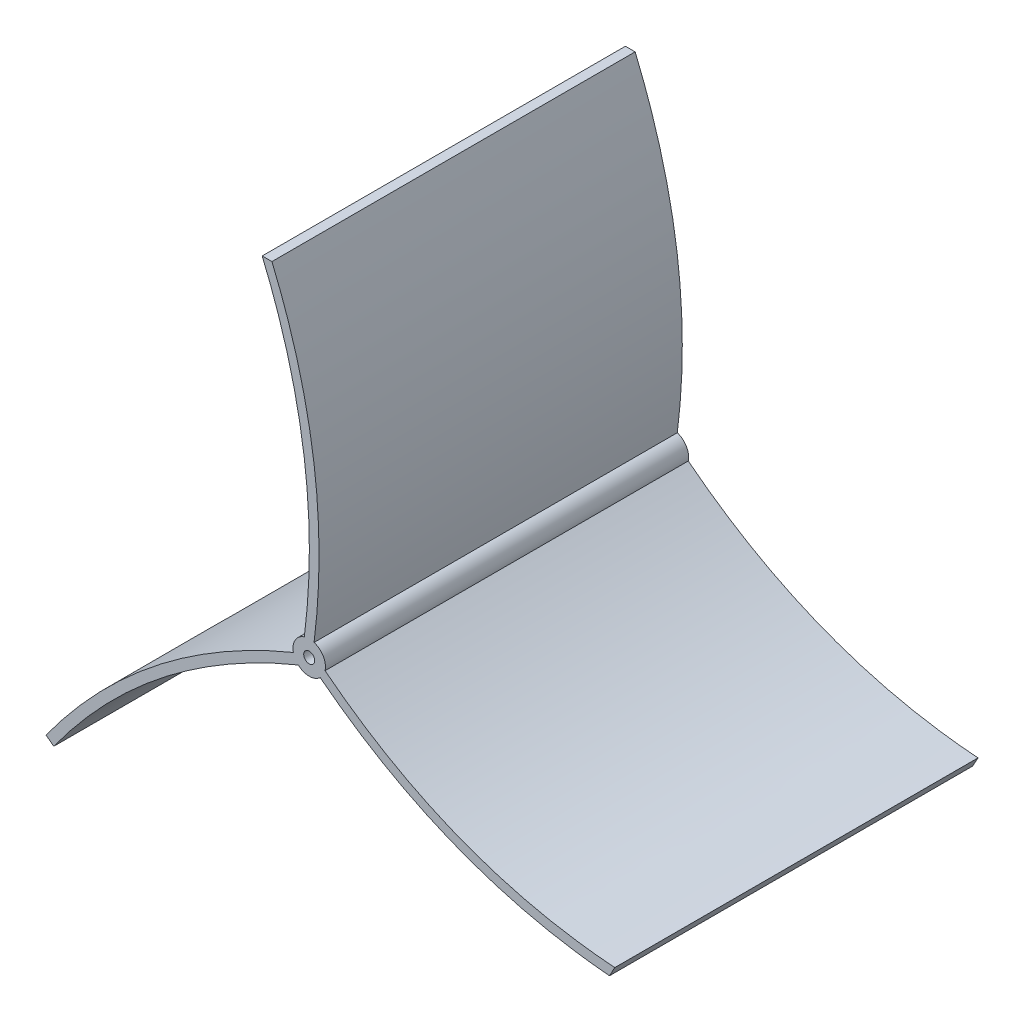
ISO-10303-21;
HEADER;
FILE_DESCRIPTION(('STEP AP214'),'2;1');
FILE_NAME('part.step','',(''),(''),'','','');
FILE_SCHEMA(('AUTOMOTIVE_DESIGN { 1 0 10303 214 1 1 1 1 }'));
ENDSEC;
DATA;
#1=APPLICATION_CONTEXT('core data for automotive mechanical design processes');
#2=APPLICATION_PROTOCOL_DEFINITION('international standard','automotive_design',2000,#1);
#3=PRODUCT_CONTEXT('',#1,'mechanical');
#4=PRODUCT('Part','Part','',(#3));
#5=PRODUCT_RELATED_PRODUCT_CATEGORY('part','',(#4));
#6=PRODUCT_DEFINITION_FORMATION('','',#4);
#7=PRODUCT_DEFINITION_CONTEXT('part definition',#1,'design');
#8=PRODUCT_DEFINITION('design','',#6,#7);
#9=PRODUCT_DEFINITION_SHAPE('','',#8);
#10=(LENGTH_UNIT() NAMED_UNIT(*) SI_UNIT(.MILLI.,.METRE.));
#11=(NAMED_UNIT(*) PLANE_ANGLE_UNIT() SI_UNIT($,.RADIAN.));
#12=(NAMED_UNIT(*) SI_UNIT($,.STERADIAN.) SOLID_ANGLE_UNIT());
#13=UNCERTAINTY_MEASURE_WITH_UNIT(LENGTH_MEASURE(1.E-05),#10,'distance_accuracy_value','');
#14=(GEOMETRIC_REPRESENTATION_CONTEXT(3) GLOBAL_UNCERTAINTY_ASSIGNED_CONTEXT((#13)) GLOBAL_UNIT_ASSIGNED_CONTEXT((#10,
#11,#12)) REPRESENTATION_CONTEXT('',''));
#15=CARTESIAN_POINT('',(0.,0.,0.));
#16=DIRECTION('',(0.,0.,1.));
#17=DIRECTION('',(1.,0.,0.));
#18=AXIS2_PLACEMENT_3D('',#15,#16,#17);
#19=CARTESIAN_POINT('',(5.13980615787074,-0.108310907923233,112.));
#20=CARTESIAN_POINT('',(44.4961998317701,-31.0242701211027,112.));
#21=CARTESIAN_POINT('',(94.4818901051121,-34.7178375879394,112.));
#22=B_SPLINE_CURVE_WITH_KNOTS('',2,(#19,#20,#21),.UNSPECIFIED.,.F.,.F.,(3,3),(0.,1.),.UNSPECIFIED.);
#23=DIRECTION('',(0.,0.,-1.));
#24=VECTOR('',#23,1.);
#25=SURFACE_OF_LINEAR_EXTRUSION('',#22,#24);
#26=CARTESIAN_POINT('',(5.13980615787074,-0.108310907923233,0.));
#27=CARTESIAN_POINT('',(44.4961998317701,-31.0242701211027,0.));
#28=CARTESIAN_POINT('',(94.4818901051121,-34.7178375879394,0.));
#29=B_SPLINE_CURVE_WITH_KNOTS('',2,(#26,#27,#28),.UNSPECIFIED.,.F.,.F.,(3,3),(0.,1.),.UNSPECIFIED.);
#30=CARTESIAN_POINT('',(5.13980615787076,-0.108310907923248,0.));
#31=VERTEX_POINT('',#30);
#32=CARTESIAN_POINT('',(94.4818901051121,-34.7178375879394,0.));
#33=VERTEX_POINT('',#32);
#34=EDGE_CURVE('E269',#31,#33,#29,.T.);
#35=ORIENTED_EDGE('',*,*,#34,.F.);
#36=DIRECTION('',(0.,0.,-1.));
#37=VECTOR('',#36,1.);
#38=CARTESIAN_POINT('',(5.13980615787076,-0.108310907923248,112.));
#39=LINE('',#38,#37);
#40=CARTESIAN_POINT('',(5.13980615787076,-0.108310907923248,112.));
#41=VERTEX_POINT('',#40);
#42=EDGE_CURVE('E11',#41,#31,#39,.T.);
#43=ORIENTED_EDGE('',*,*,#42,.F.);
#44=CARTESIAN_POINT('',(94.4818901051121,-34.7178375879394,112.));
#45=VERTEX_POINT('',#44);
#46=EDGE_CURVE('E341',#41,#45,#22,.T.);
#47=ORIENTED_EDGE('',*,*,#46,.T.);
#48=DIRECTION('',(0.,0.,-1.));
#49=VECTOR('',#48,1.);
#50=CARTESIAN_POINT('',(94.4818901051121,-34.7178375879394,112.));
#51=LINE('',#50,#49);
#52=EDGE_CURVE('E109',#45,#33,#51,.T.);
#53=ORIENTED_EDGE('',*,*,#52,.T.);
#54=EDGE_LOOP('',(#35,#43,#47,#53));
#55=FACE_BOUND('',#54,.T.);
#56=ADVANCED_FACE('F44',(#55),#25,.T.);
#57=CARTESIAN_POINT('',(0.259128247406166,0.977498989942496,112.));
#58=DIRECTION('',(0.,0.,-1.));
#59=DIRECTION('',(-1.,0.,0.));
#60=AXIS2_PLACEMENT_3D('',#57,#58,#59);
#61=CYLINDRICAL_SURFACE('',#60,5.00000000000002);
#62=CARTESIAN_POINT('',(0.259128247406166,0.977498989942496,0.));
#63=DIRECTION('',(0.,0.,1.));
#64=DIRECTION('',(1.,0.,0.));
#65=AXIS2_PLACEMENT_3D('',#62,#63,#64);
#66=CIRCLE('',#65,5.00000000000002);
#67=CARTESIAN_POINT('',(1.75912824740617,5.74719499702725,0.));
#68=VERTEX_POINT('',#67);
#69=EDGE_CURVE('E261',#31,#68,#66,.T.);
#70=ORIENTED_EDGE('',*,*,#69,.T.);
#71=DIRECTION('',(0.,0.,-1.));
#72=VECTOR('',#71,1.);
#73=CARTESIAN_POINT('',(1.75912824740617,5.74719499702725,112.));
#74=LINE('',#73,#72);
#75=CARTESIAN_POINT('',(1.75912824740617,5.74719499702725,112.));
#76=VERTEX_POINT('',#75);
#77=EDGE_CURVE('E54',#76,#68,#74,.T.);
#78=ORIENTED_EDGE('',*,*,#77,.F.);
#79=CARTESIAN_POINT('',(0.259128247406166,0.977498989942496,112.));
#80=DIRECTION('',(0.,0.,1.));
#81=DIRECTION('',(1.,0.,0.));
#82=AXIS2_PLACEMENT_3D('',#79,#80,#81);
#83=CIRCLE('',#82,5.00000000000002);
#84=EDGE_CURVE('E246',#41,#76,#83,.T.);
#85=ORIENTED_EDGE('',*,*,#84,.F.);
#86=ORIENTED_EDGE('',*,*,#42,.T.);
#87=EDGE_LOOP('',(#70,#78,#85,#86));
#88=FACE_BOUND('',#87,.T.);
#89=ADVANCED_FACE('F252',(#88),#61,.T.);
#90=CARTESIAN_POINT('',(1.75912824740617,5.74719499702723,112.));
#91=CARTESIAN_POINT('',(8.02957178731211,55.0688950949105,112.));
#92=CARTESIAN_POINT('',(-11.2408717525939,100.966248357059,112.));
#93=B_SPLINE_CURVE_WITH_KNOTS('',2,(#90,#91,#92),.UNSPECIFIED.,.F.,.F.,(3,3),(0.,1.),.UNSPECIFIED.);
#94=DIRECTION('',(0.,0.,-1.));
#95=VECTOR('',#94,1.);
#96=SURFACE_OF_LINEAR_EXTRUSION('',#93,#95);
#97=CARTESIAN_POINT('',(1.75912824740617,5.74719499702723,0.));
#98=CARTESIAN_POINT('',(8.02957178731211,55.0688950949105,0.));
#99=CARTESIAN_POINT('',(-11.2408717525939,100.966248357059,0.));
#100=B_SPLINE_CURVE_WITH_KNOTS('',2,(#97,#98,#99),.UNSPECIFIED.,.F.,.F.,(3,3),(0.,1.),.UNSPECIFIED.);
#101=CARTESIAN_POINT('',(-11.2408717525939,100.966248357059,0.));
#102=VERTEX_POINT('',#101);
#103=EDGE_CURVE('E268',#68,#102,#100,.T.);
#104=ORIENTED_EDGE('',*,*,#103,.T.);
#105=DIRECTION('',(0.,0.,-1.));
#106=VECTOR('',#105,1.);
#107=CARTESIAN_POINT('',(-11.2408717525939,100.966248357059,112.));
#108=LINE('',#107,#106);
#109=CARTESIAN_POINT('',(-11.2408717525939,100.966248357059,112.));
#110=VERTEX_POINT('',#109);
#111=EDGE_CURVE('E275',#110,#102,#108,.T.);
#112=ORIENTED_EDGE('',*,*,#111,.F.);
#113=EDGE_CURVE('E240',#76,#110,#93,.T.);
#114=ORIENTED_EDGE('',*,*,#113,.F.);
#115=ORIENTED_EDGE('',*,*,#77,.T.);
#116=EDGE_LOOP('',(#104,#112,#114,#115));
#117=FACE_BOUND('',#116,.T.);
#118=ADVANCED_FACE('F250',(#117),#96,.F.);
#119=CARTESIAN_POINT('',(0.,100.966248357059,112.));
#120=DIRECTION('',(0.,1.,0.));
#121=DIRECTION('',(0.,0.,1.));
#122=AXIS2_PLACEMENT_3D('',#119,#120,#121);
#123=PLANE('',#122);
#124=DIRECTION('',(1.,0.,0.));
#125=VECTOR('',#124,1.);
#126=CARTESIAN_POINT('',(0.,100.966248357059,0.));
#127=LINE('',#126,#125);
#128=CARTESIAN_POINT('',(-14.2408717525939,100.966248357059,0.));
#129=VERTEX_POINT('',#128);
#130=EDGE_CURVE('E280',#129,#102,#127,.T.);
#131=ORIENTED_EDGE('',*,*,#130,.F.);
#132=DIRECTION('',(0.,0.,-1.));
#133=VECTOR('',#132,1.);
#134=CARTESIAN_POINT('',(-14.2408717525939,100.966248357059,112.));
#135=LINE('',#134,#133);
#136=CARTESIAN_POINT('',(-14.2408717525939,100.966248357059,112.));
#137=VERTEX_POINT('',#136);
#138=EDGE_CURVE('E361',#137,#129,#135,.T.);
#139=ORIENTED_EDGE('',*,*,#138,.F.);
#140=DIRECTION('',(1.,0.,0.));
#141=VECTOR('',#140,1.);
#142=CARTESIAN_POINT('',(0.,100.966248357059,112.));
#143=LINE('',#142,#141);
#144=EDGE_CURVE('E233',#137,#110,#143,.T.);
#145=ORIENTED_EDGE('',*,*,#144,.T.);
#146=ORIENTED_EDGE('',*,*,#111,.T.);
#147=EDGE_LOOP('',(#131,#139,#145,#146));
#148=FACE_BOUND('',#147,.T.);
#149=ADVANCED_FACE('F223',(#148),#123,.T.);
#150=CARTESIAN_POINT('',(-1.24087175259383,5.74719499702723,112.));
#151=CARTESIAN_POINT('',(5.0295717873121,55.0688950949105,112.));
#152=CARTESIAN_POINT('',(-14.2408717525939,100.966248357059,112.));
#153=B_SPLINE_CURVE_WITH_KNOTS('',2,(#150,#151,#152),.UNSPECIFIED.,.F.,.F.,(3,3),(0.,1.),.UNSPECIFIED.);
#154=DIRECTION('',(0.,0.,-1.));
#155=VECTOR('',#154,1.);
#156=SURFACE_OF_LINEAR_EXTRUSION('',#153,#155);
#157=CARTESIAN_POINT('',(-1.24087175259383,5.74719499702723,0.));
#158=CARTESIAN_POINT('',(5.0295717873121,55.0688950949105,0.));
#159=CARTESIAN_POINT('',(-14.2408717525939,100.966248357059,0.));
#160=B_SPLINE_CURVE_WITH_KNOTS('',2,(#157,#158,#159),.UNSPECIFIED.,.F.,.F.,(3,3),(0.,1.),.UNSPECIFIED.);
#161=CARTESIAN_POINT('',(-1.24087175259383,5.74719499702725,0.));
#162=VERTEX_POINT('',#161);
#163=EDGE_CURVE('E284',#162,#129,#160,.T.);
#164=ORIENTED_EDGE('',*,*,#163,.F.);
#165=DIRECTION('',(0.,0.,-1.));
#166=VECTOR('',#165,1.);
#167=CARTESIAN_POINT('',(-1.24087175259383,5.74719499702725,112.));
#168=LINE('',#167,#166);
#169=CARTESIAN_POINT('',(-1.24087175259383,5.74719499702725,112.));
#170=VERTEX_POINT('',#169);
#171=EDGE_CURVE('E358',#170,#162,#168,.T.);
#172=ORIENTED_EDGE('',*,*,#171,.F.);
#173=EDGE_CURVE('E226',#170,#137,#153,.T.);
#174=ORIENTED_EDGE('',*,*,#173,.T.);
#175=ORIENTED_EDGE('',*,*,#138,.T.);
#176=EDGE_LOOP('',(#164,#172,#174,#175));
#177=FACE_BOUND('',#176,.T.);
#178=ADVANCED_FACE('F219',(#177),#156,.T.);
#179=CARTESIAN_POINT('',(0.259128247406166,0.977498989942496,112.));
#180=DIRECTION('',(0.,0.,-1.));
#181=DIRECTION('',(-1.,0.,0.));
#182=AXIS2_PLACEMENT_3D('',#179,#180,#181);
#183=CYLINDRICAL_SURFACE('',#182,5.00000000000002);
#184=CARTESIAN_POINT('',(0.259128247406166,0.977498989942496,0.));
#185=DIRECTION('',(0.,0.,1.));
#186=DIRECTION('',(1.,0.,0.));
#187=AXIS2_PLACEMENT_3D('',#184,#185,#186);
#188=CIRCLE('',#187,5.00000000000002);
#189=CARTESIAN_POINT('',(-4.62154966305843,-0.108310907923246,0.));
#190=VERTEX_POINT('',#189);
#191=EDGE_CURVE('E297',#162,#190,#188,.T.);
#192=ORIENTED_EDGE('',*,*,#191,.T.);
#193=DIRECTION('',(0.,0.,-1.));
#194=VECTOR('',#193,1.);
#195=CARTESIAN_POINT('',(-4.62154966305843,-0.108310907923246,112.));
#196=LINE('',#195,#194);
#197=CARTESIAN_POINT('',(-4.62154966305843,-0.108310907923246,112.));
#198=VERTEX_POINT('',#197);
#199=EDGE_CURVE('E354',#198,#190,#196,.T.);
#200=ORIENTED_EDGE('',*,*,#199,.F.);
#201=CARTESIAN_POINT('',(0.259128247406166,0.977498989942496,112.));
#202=DIRECTION('',(0.,0.,1.));
#203=DIRECTION('',(1.,0.,0.));
#204=AXIS2_PLACEMENT_3D('',#201,#202,#203);
#205=CIRCLE('',#204,5.00000000000002);
#206=EDGE_CURVE('E207',#170,#198,#205,.T.);
#207=ORIENTED_EDGE('',*,*,#206,.F.);
#208=ORIENTED_EDGE('',*,*,#171,.T.);
#209=EDGE_LOOP('',(#192,#200,#207,#208));
#210=FACE_BOUND('',#209,.T.);
#211=ADVANCED_FACE('F215',(#210),#183,.T.);
#212=CARTESIAN_POINT('',(-4.62154966305841,-0.10831090792322,112.));
#213=CARTESIAN_POINT('',(-51.2236663781932,-19.3992567466167,112.));
#214=CARTESIAN_POINT('',(-80.90469727547,-60.3159137992928,112.));
#215=B_SPLINE_CURVE_WITH_KNOTS('',2,(#212,#213,#214),.UNSPECIFIED.,.F.,.F.,(3,3),(0.,1.),.UNSPECIFIED.);
#216=DIRECTION('',(0.,0.,-1.));
#217=VECTOR('',#216,1.);
#218=SURFACE_OF_LINEAR_EXTRUSION('',#215,#217);
#219=CARTESIAN_POINT('',(-4.62154966305841,-0.10831090792322,0.));
#220=CARTESIAN_POINT('',(-51.2236663781932,-19.3992567466167,0.));
#221=CARTESIAN_POINT('',(-80.90469727547,-60.3159137992928,0.));
#222=B_SPLINE_CURVE_WITH_KNOTS('',2,(#219,#220,#221),.UNSPECIFIED.,.F.,.F.,(3,3),(0.,1.),.UNSPECIFIED.);
#223=CARTESIAN_POINT('',(-80.90469727547,-60.3159137992927,0.));
#224=VERTEX_POINT('',#223);
#225=EDGE_CURVE('E303',#190,#224,#222,.T.);
#226=ORIENTED_EDGE('',*,*,#225,.T.);
#227=DIRECTION('',(0.,0.,-1.));
#228=VECTOR('',#227,1.);
#229=CARTESIAN_POINT('',(-80.90469727547,-60.3159137992927,112.));
#230=LINE('',#229,#228);
#231=CARTESIAN_POINT('',(-80.90469727547,-60.3159137992927,112.));
#232=VERTEX_POINT('',#231);
#233=EDGE_CURVE('E351',#232,#224,#230,.T.);
#234=ORIENTED_EDGE('',*,*,#233,.F.);
#235=EDGE_CURVE('E201',#198,#232,#215,.T.);
#236=ORIENTED_EDGE('',*,*,#235,.F.);
#237=ORIENTED_EDGE('',*,*,#199,.T.);
#238=EDGE_LOOP('',(#226,#234,#236,#237));
#239=FACE_BOUND('',#238,.T.);
#240=ADVANCED_FACE('F212',(#239),#218,.F.);
#241=CARTESIAN_POINT('',(-57.8931018408659,-77.5047097173135,112.));
#242=DIRECTION('',(-0.598441329479272,-0.801166633835359,0.));
#243=DIRECTION('',(0.801166633835359,-0.598441329479272,0.));
#244=AXIS2_PLACEMENT_3D('',#241,#242,#243);
#245=PLANE('',#244);
#246=DIRECTION('',(-0.801166633835359,0.598441329479272,0.));
#247=VECTOR('',#246,1.);
#248=CARTESIAN_POINT('',(-57.8931018408659,-77.5047097173135,0.));
#249=LINE('',#248,#247);
#250=CARTESIAN_POINT('',(-78.5011973739639,-62.1112377877305,0.));
#251=VERTEX_POINT('',#250);
#252=EDGE_CURVE('E309',#251,#224,#249,.T.);
#253=ORIENTED_EDGE('',*,*,#252,.F.);
#254=DIRECTION('',(0.,0.,-1.));
#255=VECTOR('',#254,1.);
#256=CARTESIAN_POINT('',(-78.5011973739639,-62.1112377877305,112.));
#257=LINE('',#256,#255);
#258=CARTESIAN_POINT('',(-78.5011973739639,-62.1112377877305,112.));
#259=VERTEX_POINT('',#258);
#260=EDGE_CURVE('E348',#259,#251,#257,.T.);
#261=ORIENTED_EDGE('',*,*,#260,.F.);
#262=DIRECTION('',(-0.801166633835359,0.598441329479272,0.));
#263=VECTOR('',#262,1.);
#264=CARTESIAN_POINT('',(-57.8931018408659,-77.5047097173135,112.));
#265=LINE('',#264,#263);
#266=EDGE_CURVE('E194',#259,#232,#265,.T.);
#267=ORIENTED_EDGE('',*,*,#266,.T.);
#268=ORIENTED_EDGE('',*,*,#233,.T.);
#269=EDGE_LOOP('',(#253,#261,#267,#268));
#270=FACE_BOUND('',#269,.T.);
#271=ADVANCED_FACE('F186',(#270),#245,.T.);
#272=CARTESIAN_POINT('',(-3.1215496630584,-2.70638711927654,112.));
#273=CARTESIAN_POINT('',(-49.2346660978404,-21.664678742322,112.));
#274=CARTESIAN_POINT('',(-78.5011973739639,-62.1112377877306,112.));
#275=B_SPLINE_CURVE_WITH_KNOTS('',2,(#272,#273,#274),.UNSPECIFIED.,.F.,.F.,(3,3),(0.,1.),.UNSPECIFIED.);
#276=DIRECTION('',(0.,0.,-1.));
#277=VECTOR('',#276,1.);
#278=SURFACE_OF_LINEAR_EXTRUSION('',#275,#277);
#279=CARTESIAN_POINT('',(-3.1215496630584,-2.70638711927654,0.));
#280=CARTESIAN_POINT('',(-49.2346660978404,-21.664678742322,0.));
#281=CARTESIAN_POINT('',(-78.5011973739639,-62.1112377877306,0.));
#282=B_SPLINE_CURVE_WITH_KNOTS('',2,(#279,#280,#281),.UNSPECIFIED.,.F.,.F.,(3,3),(0.,1.),.UNSPECIFIED.);
#283=CARTESIAN_POINT('',(-3.12154966305841,-2.70638711927655,0.));
#284=VERTEX_POINT('',#283);
#285=EDGE_CURVE('E316',#284,#251,#282,.T.);
#286=ORIENTED_EDGE('',*,*,#285,.F.);
#287=DIRECTION('',(0.,0.,-1.));
#288=VECTOR('',#287,1.);
#289=CARTESIAN_POINT('',(-3.12154966305841,-2.70638711927655,112.));
#290=LINE('',#289,#288);
#291=CARTESIAN_POINT('',(-3.12154966305841,-2.70638711927655,112.));
#292=VERTEX_POINT('',#291);
#293=EDGE_CURVE('E158',#292,#284,#290,.T.);
#294=ORIENTED_EDGE('',*,*,#293,.F.);
#295=EDGE_CURVE('E149',#292,#259,#275,.T.);
#296=ORIENTED_EDGE('',*,*,#295,.T.);
#297=ORIENTED_EDGE('',*,*,#260,.T.);
#298=EDGE_LOOP('',(#286,#294,#296,#297));
#299=FACE_BOUND('',#298,.T.);
#300=ADVANCED_FACE('F183',(#299),#278,.T.);
#301=CARTESIAN_POINT('',(0.259128247406166,0.977498989942496,112.));
#302=DIRECTION('',(0.,0.,-1.));
#303=DIRECTION('',(-1.,0.,0.));
#304=AXIS2_PLACEMENT_3D('',#301,#302,#303);
#305=CYLINDRICAL_SURFACE('',#304,5.00000000000002);
#306=CARTESIAN_POINT('',(0.259128247406166,0.977498989942496,0.));
#307=DIRECTION('',(0.,0.,1.));
#308=DIRECTION('',(1.,0.,0.));
#309=AXIS2_PLACEMENT_3D('',#306,#307,#308);
#310=CIRCLE('',#309,5.00000000000002);
#311=CARTESIAN_POINT('',(3.63980615787075,-2.70638711927655,0.));
#312=VERTEX_POINT('',#311);
#313=EDGE_CURVE('E156',#284,#312,#310,.T.);
#314=ORIENTED_EDGE('',*,*,#313,.T.);
#315=DIRECTION('',(0.,0.,-1.));
#316=VECTOR('',#315,1.);
#317=CARTESIAN_POINT('',(3.63980615787075,-2.70638711927655,112.));
#318=LINE('',#317,#316);
#319=CARTESIAN_POINT('',(3.63980615787075,-2.70638711927655,112.));
#320=VERTEX_POINT('',#319);
#321=EDGE_CURVE('E153',#320,#312,#318,.T.);
#322=ORIENTED_EDGE('',*,*,#321,.F.);
#323=CARTESIAN_POINT('',(0.259128247406166,0.977498989942496,112.));
#324=DIRECTION('',(0.,0.,1.));
#325=DIRECTION('',(1.,0.,0.));
#326=AXIS2_PLACEMENT_3D('',#323,#324,#325);
#327=CIRCLE('',#326,5.00000000000002);
#328=EDGE_CURVE('E141',#292,#320,#327,.T.);
#329=ORIENTED_EDGE('',*,*,#328,.F.);
#330=ORIENTED_EDGE('',*,*,#293,.T.);
#331=EDGE_LOOP('',(#314,#322,#329,#330));
#332=FACE_BOUND('',#331,.T.);
#333=ADVANCED_FACE('F154',(#332),#305,.T.);
#334=CARTESIAN_POINT('',(3.63980615787073,-2.70638711927654,112.));
#335=CARTESIAN_POINT('',(43.0247697547691,-33.4143048794802,112.));
#336=CARTESIAN_POINT('',(92.8498820859265,-37.7178375879394,112.));
#337=B_SPLINE_CURVE_WITH_KNOTS('',2,(#334,#335,#336),.UNSPECIFIED.,.F.,.F.,(3,3),(0.,1.),.UNSPECIFIED.);
#338=DIRECTION('',(0.,0.,-1.));
#339=VECTOR('',#338,1.);
#340=SURFACE_OF_LINEAR_EXTRUSION('',#337,#339);
#341=CARTESIAN_POINT('',(3.63980615787073,-2.70638711927654,0.));
#342=CARTESIAN_POINT('',(43.0247697547691,-33.4143048794802,0.));
#343=CARTESIAN_POINT('',(92.8498820859265,-37.7178375879394,0.));
#344=B_SPLINE_CURVE_WITH_KNOTS('',2,(#341,#342,#343),.UNSPECIFIED.,.F.,.F.,(3,3),(0.,1.),.UNSPECIFIED.);
#345=CARTESIAN_POINT('',(92.8498820859265,-37.7178375879394,0.));
#346=VERTEX_POINT('',#345);
#347=EDGE_CURVE('E102',#312,#346,#344,.T.);
#348=ORIENTED_EDGE('',*,*,#347,.T.);
#349=DIRECTION('',(0.,0.,-1.));
#350=VECTOR('',#349,1.);
#351=CARTESIAN_POINT('',(92.8498820859265,-37.7178375879394,112.));
#352=LINE('',#351,#350);
#353=CARTESIAN_POINT('',(92.8498820859265,-37.7178375879394,112.));
#354=VERTEX_POINT('',#353);
#355=EDGE_CURVE('E159',#354,#346,#352,.T.);
#356=ORIENTED_EDGE('',*,*,#355,.F.);
#357=EDGE_CURVE('E146',#320,#354,#337,.T.);
#358=ORIENTED_EDGE('',*,*,#357,.F.);
#359=ORIENTED_EDGE('',*,*,#321,.T.);
#360=EDGE_LOOP('',(#348,#356,#358,#359));
#361=FACE_BOUND('',#360,.T.);
#362=ADVANCED_FACE('F161',(#361),#340,.F.);
#363=CARTESIAN_POINT('',(87.479807751687,-47.5892492558542,112.));
#364=DIRECTION('',(-0.878431165435291,0.477868902097632,0.));
#365=DIRECTION('',(-0.477868902097632,-0.878431165435291,0.));
#366=AXIS2_PLACEMENT_3D('',#363,#364,#365);
#367=PLANE('',#366);
#368=DIRECTION('',(0.477868902097632,0.878431165435291,0.));
#369=VECTOR('',#368,1.);
#370=CARTESIAN_POINT('',(87.479807751687,-47.5892492558542,0.));
#371=LINE('',#370,#369);
#372=EDGE_CURVE('E331',#346,#33,#371,.T.);
#373=ORIENTED_EDGE('',*,*,#372,.T.);
#374=ORIENTED_EDGE('',*,*,#52,.F.);
#375=DIRECTION('',(0.477868902097632,0.878431165435291,0.));
#376=VECTOR('',#375,1.);
#377=CARTESIAN_POINT('',(87.479807751687,-47.5892492558542,112.));
#378=LINE('',#377,#376);
#379=EDGE_CURVE('E62',#354,#45,#378,.T.);
#380=ORIENTED_EDGE('',*,*,#379,.F.);
#381=ORIENTED_EDGE('',*,*,#355,.T.);
#382=EDGE_LOOP('',(#373,#374,#380,#381));
#383=FACE_BOUND('',#382,.T.);
#384=ADVANCED_FACE('F179',(#383),#367,.F.);
#385=CARTESIAN_POINT('',(0.259128247406166,0.977498989942496,112.));
#386=DIRECTION('',(0.,0.,-1.));
#387=DIRECTION('',(-1.,0.,0.));
#388=AXIS2_PLACEMENT_3D('',#385,#386,#387);
#389=CYLINDRICAL_SURFACE('',#388,1.7);
#390=CARTESIAN_POINT('',(0.259128247406166,0.977498989942496,112.));
#391=DIRECTION('',(0.,0.,1.));
#392=DIRECTION('',(1.,0.,0.));
#393=AXIS2_PLACEMENT_3D('',#390,#391,#392);
#394=CIRCLE('',#393,1.7);
#395=CARTESIAN_POINT('',(1.95912824740617,0.977498989942496,112.));
#396=VERTEX_POINT('',#395);
#397=EDGE_CURVE('E165',#396,#396,#394,.T.);
#398=ORIENTED_EDGE('',*,*,#397,.T.);
#399=EDGE_LOOP('',(#398));
#400=FACE_BOUND('',#399,.T.);
#401=CARTESIAN_POINT('',(0.259128247406166,0.977498989942496,0.));
#402=DIRECTION('',(0.,0.,1.));
#403=DIRECTION('',(1.,0.,0.));
#404=AXIS2_PLACEMENT_3D('',#401,#402,#403);
#405=CIRCLE('',#404,1.7);
#406=CARTESIAN_POINT('',(1.95912824740617,0.977498989942496,0.));
#407=VERTEX_POINT('',#406);
#408=EDGE_CURVE('E337',#407,#407,#405,.T.);
#409=ORIENTED_EDGE('',*,*,#408,.F.);
#410=EDGE_LOOP('',(#409));
#411=FACE_BOUND('',#410,.T.);
#412=ADVANCED_FACE('F393',(#400,#411),#389,.F.);
#413=CARTESIAN_POINT('',(0.,0.,112.));
#414=DIRECTION('',(0.,0.,1.));
#415=DIRECTION('',(1.,0.,0.));
#416=AXIS2_PLACEMENT_3D('',#413,#414,#415);
#417=PLANE('',#416);
#418=ORIENTED_EDGE('',*,*,#46,.F.);
#419=ORIENTED_EDGE('',*,*,#84,.T.);
#420=ORIENTED_EDGE('',*,*,#113,.T.);
#421=ORIENTED_EDGE('',*,*,#144,.F.);
#422=ORIENTED_EDGE('',*,*,#173,.F.);
#423=ORIENTED_EDGE('',*,*,#206,.T.);
#424=ORIENTED_EDGE('',*,*,#235,.T.);
#425=ORIENTED_EDGE('',*,*,#266,.F.);
#426=ORIENTED_EDGE('',*,*,#295,.F.);
#427=ORIENTED_EDGE('',*,*,#328,.T.);
#428=ORIENTED_EDGE('',*,*,#357,.T.);
#429=ORIENTED_EDGE('',*,*,#379,.T.);
#430=EDGE_LOOP('',(#418,#419,#420,#421,#422,#423,#424,#425,#426,#427,#428,#429));
#431=FACE_BOUND('',#430,.T.);
#432=ORIENTED_EDGE('',*,*,#397,.F.);
#433=EDGE_LOOP('',(#432));
#434=FACE_BOUND('',#433,.T.);
#435=ADVANCED_FACE('F143',(#431,#434),#417,.T.);
#436=CARTESIAN_POINT('',(0.,0.,0.));
#437=DIRECTION('',(0.,0.,1.));
#438=DIRECTION('',(1.,0.,0.));
#439=AXIS2_PLACEMENT_3D('',#436,#437,#438);
#440=PLANE('',#439);
#441=ORIENTED_EDGE('',*,*,#34,.T.);
#442=ORIENTED_EDGE('',*,*,#372,.F.);
#443=ORIENTED_EDGE('',*,*,#347,.F.);
#444=ORIENTED_EDGE('',*,*,#313,.F.);
#445=ORIENTED_EDGE('',*,*,#285,.T.);
#446=ORIENTED_EDGE('',*,*,#252,.T.);
#447=ORIENTED_EDGE('',*,*,#225,.F.);
#448=ORIENTED_EDGE('',*,*,#191,.F.);
#449=ORIENTED_EDGE('',*,*,#163,.T.);
#450=ORIENTED_EDGE('',*,*,#130,.T.);
#451=ORIENTED_EDGE('',*,*,#103,.F.);
#452=ORIENTED_EDGE('',*,*,#69,.F.);
#453=EDGE_LOOP('',(#441,#442,#443,#444,#445,#446,#447,#448,#449,#450,#451,#452));
#454=FACE_BOUND('',#453,.T.);
#455=ORIENTED_EDGE('',*,*,#408,.T.);
#456=EDGE_LOOP('',(#455));
#457=FACE_BOUND('',#456,.T.);
#458=ADVANCED_FACE('F276',(#454,#457),#440,.F.);
#459=CLOSED_SHELL('',(#56,#89,#118,#149,#178,#211,#240,#271,#300,#333,#362,#384,#412,#435,#458));
#460=MANIFOLD_SOLID_BREP('B2',#459);
#461=ADVANCED_BREP_SHAPE_REPRESENTATION('',(#18,#460),#14);
#462=SHAPE_DEFINITION_REPRESENTATION(#9,#461);
ENDSEC;
END-ISO-10303-21;
